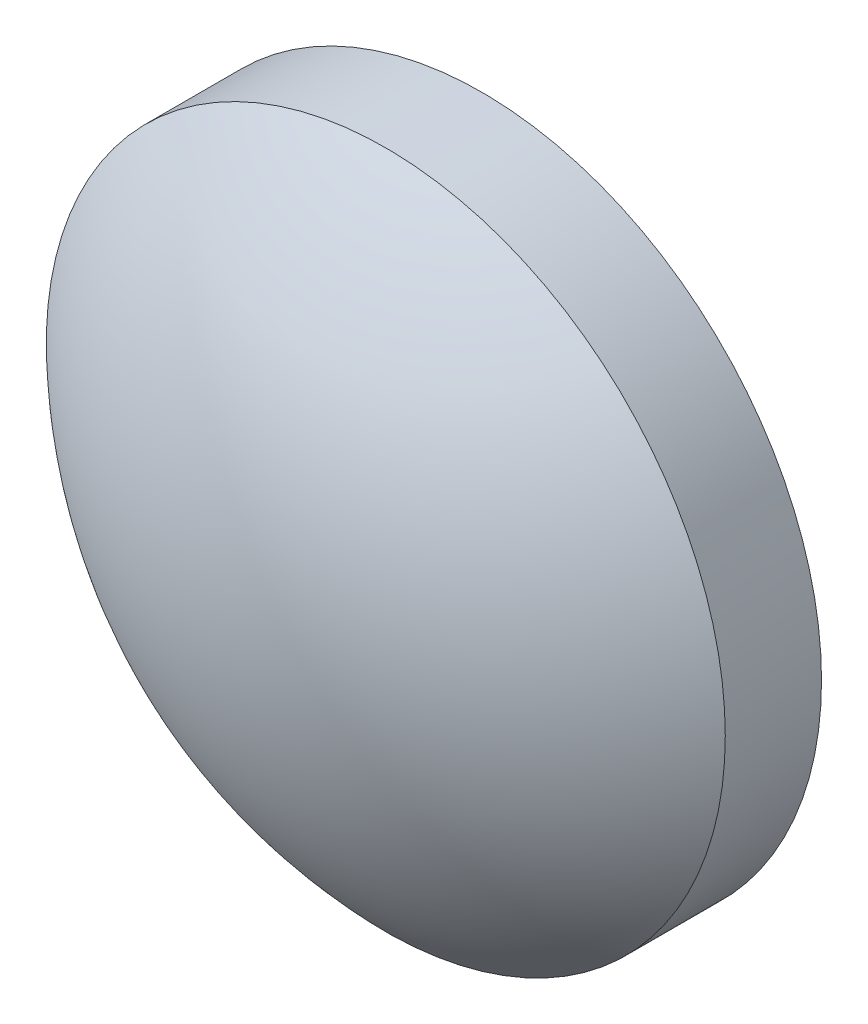
ISO-10303-21;
HEADER;
FILE_DESCRIPTION(('STEP AP214'),'2;1');
FILE_NAME('part.step','',(''),(''),'','','');
FILE_SCHEMA(('AUTOMOTIVE_DESIGN { 1 0 10303 214 1 1 1 1 }'));
ENDSEC;
DATA;
#1=APPLICATION_CONTEXT('core data for automotive mechanical design processes');
#2=APPLICATION_PROTOCOL_DEFINITION('international standard','automotive_design',2000,#1);
#3=PRODUCT_CONTEXT('',#1,'mechanical');
#4=PRODUCT('Part','Part','',(#3));
#5=PRODUCT_RELATED_PRODUCT_CATEGORY('part','',(#4));
#6=PRODUCT_DEFINITION_FORMATION('','',#4);
#7=PRODUCT_DEFINITION_CONTEXT('part definition',#1,'design');
#8=PRODUCT_DEFINITION('design','',#6,#7);
#9=PRODUCT_DEFINITION_SHAPE('','',#8);
#10=(LENGTH_UNIT() NAMED_UNIT(*) SI_UNIT(.MILLI.,.METRE.));
#11=(NAMED_UNIT(*) PLANE_ANGLE_UNIT() SI_UNIT($,.RADIAN.));
#12=(NAMED_UNIT(*) SI_UNIT($,.STERADIAN.) SOLID_ANGLE_UNIT());
#13=UNCERTAINTY_MEASURE_WITH_UNIT(LENGTH_MEASURE(1.E-05),#10,'distance_accuracy_value','');
#14=(GEOMETRIC_REPRESENTATION_CONTEXT(3) GLOBAL_UNCERTAINTY_ASSIGNED_CONTEXT((#13)) GLOBAL_UNIT_ASSIGNED_CONTEXT((#10,
#11,#12)) REPRESENTATION_CONTEXT('',''));
#15=CARTESIAN_POINT('',(0.,0.,0.));
#16=DIRECTION('',(0.,0.,1.));
#17=DIRECTION('',(1.,0.,0.));
#18=AXIS2_PLACEMENT_3D('',#15,#16,#17);
#19=CARTESIAN_POINT('',(0.00300019567770361,0.,-7.03005483783373));
#20=DIRECTION('',(0.,-1.,0.));
#21=DIRECTION('',(1.,0.,0.));
#22=AXIS2_PLACEMENT_3D('',#19,#20,#21);
#23=CIRCLE('',#22,9.2);
#24=TRIMMED_CURVE('',#23,(PARAMETER_VALUE(-1.57112243502651)),
(PARAMETER_VALUE(1.57112243502651)),.T.,.PARAMETER.);
#25=CARTESIAN_POINT('',(0.,0.,-7.03005483783373));
#26=DIRECTION('',(0.,0.,1.));
#27=AXIS1_PLACEMENT('',#25,#26);
#28=SURFACE_OF_REVOLUTION('',#24,#27);
#29=CARTESIAN_POINT('',(0.,0.,2.16994467297201));
#30=VERTEX_POINT('',#29);
#31=VERTEX_LOOP('',#30);
#32=FACE_BOUND('',#31,.T.);
#33=CARTESIAN_POINT('',(0.,0.,-0.370055327027987));
#34=DIRECTION('',(0.,0.,1.));
#35=DIRECTION('',(1.,0.,0.));
#36=AXIS2_PLACEMENT_3D('',#33,#34,#35);
#37=CIRCLE('',#36,6.35);
#38=CARTESIAN_POINT('',(6.35,0.,-0.370055327027987));
#39=VERTEX_POINT('',#38);
#40=EDGE_CURVE('E21',#39,#39,#37,.T.);
#41=ORIENTED_EDGE('',*,*,#40,.T.);
#42=EDGE_LOOP('',(#41));
#43=FACE_BOUND('',#42,.T.);
#44=ADVANCED_FACE('F15',(#32,#43),#28,.T.);
#45=CARTESIAN_POINT('',(0.,0.,-2.17005532702799));
#46=DIRECTION('',(0.,0.,1.));
#47=DIRECTION('',(1.,0.,0.));
#48=AXIS2_PLACEMENT_3D('',#45,#46,#47);
#49=PLANE('',#48);
#50=CARTESIAN_POINT('',(0.,0.,-2.17005532702799));
#51=DIRECTION('',(0.,0.,1.));
#52=DIRECTION('',(1.,0.,0.));
#53=AXIS2_PLACEMENT_3D('',#50,#51,#52);
#54=CIRCLE('',#53,6.35);
#55=CARTESIAN_POINT('',(6.35,0.,-2.17005532702799));
#56=VERTEX_POINT('',#55);
#57=EDGE_CURVE('E10',#56,#56,#54,.T.);
#58=ORIENTED_EDGE('',*,*,#57,.F.);
#59=EDGE_LOOP('',(#58));
#60=FACE_BOUND('',#59,.T.);
#61=ADVANCED_FACE('F26',(#60),#49,.F.);
#62=CARTESIAN_POINT('',(0.,0.,25.5942590743012));
#63=DIRECTION('',(0.,0.,1.));
#64=DIRECTION('',(1.,0.,0.));
#65=AXIS2_PLACEMENT_3D('',#62,#63,#64);
#66=CYLINDRICAL_SURFACE('',#65,6.35);
#67=ORIENTED_EDGE('',*,*,#40,.F.);
#68=EDGE_LOOP('',(#67));
#69=FACE_BOUND('',#68,.T.);
#70=ORIENTED_EDGE('',*,*,#57,.T.);
#71=EDGE_LOOP('',(#70));
#72=FACE_BOUND('',#71,.T.);
#73=ADVANCED_FACE('F30',(#69,#72),#66,.T.);
#74=CLOSED_SHELL('',(#44,#61,#73));
#75=MANIFOLD_SOLID_BREP('B1',#74);
#76=ADVANCED_BREP_SHAPE_REPRESENTATION('',(#18,#75),#14);
#77=SHAPE_DEFINITION_REPRESENTATION(#9,#76);
ENDSEC;
END-ISO-10303-21;
